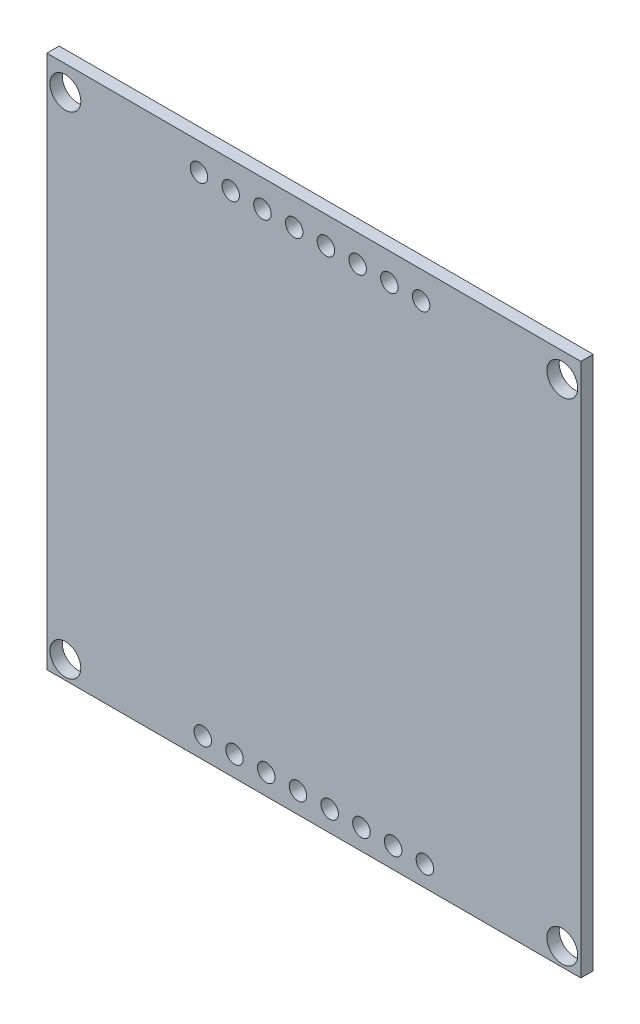
ISO-10303-21;
HEADER;
FILE_DESCRIPTION(('STEP AP214'),'2;1');
FILE_NAME('part.step','',(''),(''),'','','');
FILE_SCHEMA(('AUTOMOTIVE_DESIGN { 1 0 10303 214 1 1 1 1 }'));
ENDSEC;
DATA;
#1=APPLICATION_CONTEXT('core data for automotive mechanical design processes');
#2=APPLICATION_PROTOCOL_DEFINITION('international standard','automotive_design',2000,#1);
#3=PRODUCT_CONTEXT('',#1,'mechanical');
#4=PRODUCT('Part','Part','',(#3));
#5=PRODUCT_RELATED_PRODUCT_CATEGORY('part','',(#4));
#6=PRODUCT_DEFINITION_FORMATION('','',#4);
#7=PRODUCT_DEFINITION_CONTEXT('part definition',#1,'design');
#8=PRODUCT_DEFINITION('design','',#6,#7);
#9=PRODUCT_DEFINITION_SHAPE('','',#8);
#10=(LENGTH_UNIT() NAMED_UNIT(*) SI_UNIT(.MILLI.,.METRE.));
#11=(NAMED_UNIT(*) PLANE_ANGLE_UNIT() SI_UNIT($,.RADIAN.));
#12=(NAMED_UNIT(*) SI_UNIT($,.STERADIAN.) SOLID_ANGLE_UNIT());
#13=UNCERTAINTY_MEASURE_WITH_UNIT(LENGTH_MEASURE(1.E-05),#10,'distance_accuracy_value','');
#14=(GEOMETRIC_REPRESENTATION_CONTEXT(3) GLOBAL_UNCERTAINTY_ASSIGNED_CONTEXT((#13)) GLOBAL_UNIT_ASSIGNED_CONTEXT((#10,
#11,#12)) REPRESENTATION_CONTEXT('',''));
#15=CARTESIAN_POINT('',(0.,0.,0.));
#16=DIRECTION('',(0.,0.,1.));
#17=DIRECTION('',(1.,0.,0.));
#18=AXIS2_PLACEMENT_3D('',#15,#16,#17);
#19=CARTESIAN_POINT('',(0.,0.,1.));
#20=DIRECTION('',(0.,0.,-1.));
#21=DIRECTION('',(-1.,0.,0.));
#22=AXIS2_PLACEMENT_3D('',#19,#20,#21);
#23=PLANE('',#22);
#24=CARTESIAN_POINT('',(1.5,1.47673648000744,1.));
#25=DIRECTION('',(0.,0.,1.));
#26=DIRECTION('',(1.,0.,0.));
#27=AXIS2_PLACEMENT_3D('',#24,#25,#26);
#28=CIRCLE('',#27,1.25);
#29=CARTESIAN_POINT('',(2.75,1.47673648000744,1.));
#30=VERTEX_POINT('',#29);
#31=EDGE_CURVE('E216',#30,#30,#28,.T.);
#32=ORIENTED_EDGE('',*,*,#31,.F.);
#33=EDGE_LOOP('',(#32));
#34=FACE_BOUND('',#33,.T.);
#35=CARTESIAN_POINT('',(41.75,1.47673648000744,1.));
#36=DIRECTION('',(0.,0.,1.));
#37=DIRECTION('',(-1.,0.,0.));
#38=AXIS2_PLACEMENT_3D('',#35,#36,#37);
#39=CIRCLE('',#38,1.25);
#40=CARTESIAN_POINT('',(40.5,1.47673648000744,1.));
#41=VERTEX_POINT('',#40);
#42=EDGE_CURVE('E204',#41,#41,#39,.T.);
#43=ORIENTED_EDGE('',*,*,#42,.F.);
#44=EDGE_LOOP('',(#43));
#45=FACE_BOUND('',#44,.T.);
#46=CARTESIAN_POINT('',(20.34,1.67673648000722,1.));
#47=DIRECTION('',(0.,0.,1.));
#48=DIRECTION('',(-1.,0.,0.));
#49=AXIS2_PLACEMENT_3D('',#46,#47,#48);
#50=CIRCLE('',#49,0.707384328542562);
#51=CARTESIAN_POINT('',(19.6326156714574,1.67673648000722,1.));
#52=VERTEX_POINT('',#51);
#53=EDGE_CURVE('E192',#52,#52,#50,.T.);
#54=ORIENTED_EDGE('',*,*,#53,.F.);
#55=EDGE_LOOP('',(#54));
#56=FACE_BOUND('',#55,.T.);
#57=CARTESIAN_POINT('',(25.48,1.67673648000723,1.));
#58=DIRECTION('',(0.,0.,1.));
#59=DIRECTION('',(-1.,0.,0.));
#60=AXIS2_PLACEMENT_3D('',#57,#58,#59);
#61=CIRCLE('',#60,0.707384328542562);
#62=CARTESIAN_POINT('',(24.7726156714574,1.67673648000723,1.));
#63=VERTEX_POINT('',#62);
#64=EDGE_CURVE('E180',#63,#63,#61,.T.);
#65=ORIENTED_EDGE('',*,*,#64,.F.);
#66=EDGE_LOOP('',(#65));
#67=FACE_BOUND('',#66,.T.);
#68=CARTESIAN_POINT('',(30.62,1.67673648000723,1.));
#69=DIRECTION('',(0.,0.,1.));
#70=DIRECTION('',(-1.,0.,0.));
#71=AXIS2_PLACEMENT_3D('',#68,#69,#70);
#72=CIRCLE('',#71,0.707384328542566);
#73=CARTESIAN_POINT('',(29.9126156714574,1.67673648000723,1.));
#74=VERTEX_POINT('',#73);
#75=EDGE_CURVE('E168',#74,#74,#72,.T.);
#76=ORIENTED_EDGE('',*,*,#75,.F.);
#77=EDGE_LOOP('',(#76));
#78=FACE_BOUND('',#77,.T.);
#79=CARTESIAN_POINT('',(30.3125670065612,41.0314532498455,1.));
#80=DIRECTION('',(0.,0.,1.));
#81=DIRECTION('',(1.,0.,0.));
#82=AXIS2_PLACEMENT_3D('',#79,#80,#81);
#83=CIRCLE('',#82,0.707384328542565);
#84=CARTESIAN_POINT('',(31.0199513351037,41.0314532498455,1.));
#85=VERTEX_POINT('',#84);
#86=EDGE_CURVE('E156',#85,#85,#83,.T.);
#87=ORIENTED_EDGE('',*,*,#86,.F.);
#88=EDGE_LOOP('',(#87));
#89=FACE_BOUND('',#88,.T.);
#90=CARTESIAN_POINT('',(25.1725697380948,41.0367523213182,1.));
#91=DIRECTION('',(0.,0.,1.));
#92=DIRECTION('',(1.,0.,0.));
#93=AXIS2_PLACEMENT_3D('',#90,#91,#92);
#94=CIRCLE('',#93,0.707384328542558);
#95=CARTESIAN_POINT('',(25.8799540666374,41.0367523213182,1.));
#96=VERTEX_POINT('',#95);
#97=EDGE_CURVE('E144',#96,#96,#94,.T.);
#98=ORIENTED_EDGE('',*,*,#97,.F.);
#99=EDGE_LOOP('',(#98));
#100=FACE_BOUND('',#99,.T.);
#101=CARTESIAN_POINT('',(20.0325724696285,41.0420513927909,1.));
#102=DIRECTION('',(0.,0.,1.));
#103=DIRECTION('',(1.,0.,0.));
#104=AXIS2_PLACEMENT_3D('',#101,#102,#103);
#105=CIRCLE('',#104,0.707384328542558);
#106=CARTESIAN_POINT('',(20.739956798171,41.0420513927909,1.));
#107=VERTEX_POINT('',#106);
#108=EDGE_CURVE('E132',#107,#107,#105,.T.);
#109=ORIENTED_EDGE('',*,*,#108,.F.);
#110=EDGE_LOOP('',(#109));
#111=FACE_BOUND('',#110,.T.);
#112=CARTESIAN_POINT('',(14.8925752011621,41.0473504642636,1.));
#113=DIRECTION('',(0.,0.,1.));
#114=DIRECTION('',(1.,0.,0.));
#115=AXIS2_PLACEMENT_3D('',#112,#113,#114);
#116=CIRCLE('',#115,0.707384328542558);
#117=CARTESIAN_POINT('',(15.5999595297047,41.0473504642636,1.));
#118=VERTEX_POINT('',#117);
#119=EDGE_CURVE('E120',#118,#118,#116,.T.);
#120=ORIENTED_EDGE('',*,*,#119,.F.);
#121=EDGE_LOOP('',(#120));
#122=FACE_BOUND('',#121,.T.);
#123=CARTESIAN_POINT('',(12.3225765669289,41.05,1.));
#124=DIRECTION('',(0.,0.,1.));
#125=DIRECTION('',(1.,0.,0.));
#126=AXIS2_PLACEMENT_3D('',#123,#124,#125);
#127=CIRCLE('',#126,0.70738432854256);
#128=CARTESIAN_POINT('',(13.0299608954715,41.05,1.));
#129=VERTEX_POINT('',#128);
#130=EDGE_CURVE('E99',#129,#129,#127,.T.);
#131=ORIENTED_EDGE('',*,*,#130,.F.);
#132=EDGE_LOOP('',(#131));
#133=FACE_BOUND('',#132,.T.);
#134=DIRECTION('',(0.,-1.,0.));
#135=VECTOR('',#134,1.);
#136=CARTESIAN_POINT('',(0.,0.,1.));
#137=LINE('',#136,#135);
#138=CARTESIAN_POINT('',(0.,43.25,1.));
#139=VERTEX_POINT('',#138);
#140=CARTESIAN_POINT('',(0.,0.,1.));
#141=VERTEX_POINT('',#140);
#142=EDGE_CURVE('E84',#139,#141,#137,.T.);
#143=ORIENTED_EDGE('',*,*,#142,.T.);
#144=DIRECTION('',(1.,0.,0.));
#145=VECTOR('',#144,1.);
#146=CARTESIAN_POINT('',(0.,0.,1.));
#147=LINE('',#146,#145);
#148=CARTESIAN_POINT('',(43.25,0.,1.));
#149=VERTEX_POINT('',#148);
#150=EDGE_CURVE('E79',#141,#149,#147,.T.);
#151=ORIENTED_EDGE('',*,*,#150,.T.);
#152=DIRECTION('',(0.,1.,0.));
#153=VECTOR('',#152,1.);
#154=CARTESIAN_POINT('',(43.25,0.,1.));
#155=LINE('',#154,#153);
#156=CARTESIAN_POINT('',(43.25,43.25,1.));
#157=VERTEX_POINT('',#156);
#158=EDGE_CURVE('E82',#149,#157,#155,.T.);
#159=ORIENTED_EDGE('',*,*,#158,.T.);
#160=DIRECTION('',(-1.,0.,0.));
#161=VECTOR('',#160,1.);
#162=CARTESIAN_POINT('',(0.,43.25,1.));
#163=LINE('',#162,#161);
#164=EDGE_CURVE('E49',#157,#139,#163,.T.);
#165=ORIENTED_EDGE('',*,*,#164,.T.);
#166=EDGE_LOOP('',(#143,#151,#159,#165));
#167=FACE_BOUND('',#166,.T.);
#168=CARTESIAN_POINT('',(41.75,41.25,1.));
#169=DIRECTION('',(0.,0.,1.));
#170=DIRECTION('',(1.,0.,0.));
#171=AXIS2_PLACEMENT_3D('',#168,#169,#170);
#172=CIRCLE('',#171,1.25);
#173=CARTESIAN_POINT('',(43.,41.25,1.));
#174=VERTEX_POINT('',#173);
#175=EDGE_CURVE('E114',#174,#174,#172,.T.);
#176=ORIENTED_EDGE('',*,*,#175,.F.);
#177=EDGE_LOOP('',(#176));
#178=FACE_BOUND('',#177,.T.);
#179=CARTESIAN_POINT('',(17.4625738353953,41.0447009285273,1.));
#180=DIRECTION('',(0.,0.,1.));
#181=DIRECTION('',(1.,0.,0.));
#182=AXIS2_PLACEMENT_3D('',#179,#180,#181);
#183=CIRCLE('',#182,0.707384328542562);
#184=CARTESIAN_POINT('',(18.1699581639378,41.0447009285273,1.));
#185=VERTEX_POINT('',#184);
#186=EDGE_CURVE('E126',#185,#185,#183,.T.);
#187=ORIENTED_EDGE('',*,*,#186,.F.);
#188=EDGE_LOOP('',(#187));
#189=FACE_BOUND('',#188,.T.);
#190=CARTESIAN_POINT('',(22.6025711038616,41.0394018570546,1.));
#191=DIRECTION('',(0.,0.,1.));
#192=DIRECTION('',(1.,0.,0.));
#193=AXIS2_PLACEMENT_3D('',#190,#191,#192);
#194=CIRCLE('',#193,0.707384328542562);
#195=CARTESIAN_POINT('',(23.3099554324042,41.0394018570546,1.));
#196=VERTEX_POINT('',#195);
#197=EDGE_CURVE('E138',#196,#196,#194,.T.);
#198=ORIENTED_EDGE('',*,*,#197,.F.);
#199=EDGE_LOOP('',(#198));
#200=FACE_BOUND('',#199,.T.);
#201=CARTESIAN_POINT('',(27.742568372328,41.0341027855819,1.));
#202=DIRECTION('',(0.,0.,1.));
#203=DIRECTION('',(1.,0.,0.));
#204=AXIS2_PLACEMENT_3D('',#201,#202,#203);
#205=CIRCLE('',#204,0.707384328542558);
#206=CARTESIAN_POINT('',(28.4499527008705,41.0341027855819,1.));
#207=VERTEX_POINT('',#206);
#208=EDGE_CURVE('E150',#207,#207,#205,.T.);
#209=ORIENTED_EDGE('',*,*,#208,.F.);
#210=EDGE_LOOP('',(#209));
#211=FACE_BOUND('',#210,.T.);
#212=CARTESIAN_POINT('',(1.5,41.25,1.));
#213=DIRECTION('',(0.,0.,1.));
#214=DIRECTION('',(-1.,0.,0.));
#215=AXIS2_PLACEMENT_3D('',#212,#213,#214);
#216=CIRCLE('',#215,1.25);
#217=CARTESIAN_POINT('',(0.250000000000003,41.25,1.));
#218=VERTEX_POINT('',#217);
#219=EDGE_CURVE('E162',#218,#218,#216,.T.);
#220=ORIENTED_EDGE('',*,*,#219,.F.);
#221=EDGE_LOOP('',(#220));
#222=FACE_BOUND('',#221,.T.);
#223=CARTESIAN_POINT('',(28.05,1.67673648000723,1.));
#224=DIRECTION('',(0.,0.,1.));
#225=DIRECTION('',(-1.,0.,0.));
#226=AXIS2_PLACEMENT_3D('',#223,#224,#225);
#227=CIRCLE('',#226,0.707384328542562);
#228=CARTESIAN_POINT('',(27.3426156714574,1.67673648000723,1.));
#229=VERTEX_POINT('',#228);
#230=EDGE_CURVE('E174',#229,#229,#227,.T.);
#231=ORIENTED_EDGE('',*,*,#230,.F.);
#232=EDGE_LOOP('',(#231));
#233=FACE_BOUND('',#232,.T.);
#234=CARTESIAN_POINT('',(22.91,1.67673648000722,1.));
#235=DIRECTION('',(0.,0.,1.));
#236=DIRECTION('',(-1.,0.,0.));
#237=AXIS2_PLACEMENT_3D('',#234,#235,#236);
#238=CIRCLE('',#237,0.707384328542562);
#239=CARTESIAN_POINT('',(22.2026156714574,1.67673648000722,1.));
#240=VERTEX_POINT('',#239);
#241=EDGE_CURVE('E186',#240,#240,#238,.T.);
#242=ORIENTED_EDGE('',*,*,#241,.F.);
#243=EDGE_LOOP('',(#242));
#244=FACE_BOUND('',#243,.T.);
#245=CARTESIAN_POINT('',(17.77,1.67673648000722,1.));
#246=DIRECTION('',(0.,0.,1.));
#247=DIRECTION('',(-1.,0.,0.));
#248=AXIS2_PLACEMENT_3D('',#245,#246,#247);
#249=CIRCLE('',#248,0.707384328542562);
#250=CARTESIAN_POINT('',(17.0626156714574,1.67673648000722,1.));
#251=VERTEX_POINT('',#250);
#252=EDGE_CURVE('E198',#251,#251,#249,.T.);
#253=ORIENTED_EDGE('',*,*,#252,.F.);
#254=EDGE_LOOP('',(#253));
#255=FACE_BOUND('',#254,.T.);
#256=CARTESIAN_POINT('',(15.2,1.67673648000722,1.));
#257=DIRECTION('',(0.,0.,1.));
#258=DIRECTION('',(-1.,0.,0.));
#259=AXIS2_PLACEMENT_3D('',#256,#257,#258);
#260=CIRCLE('',#259,0.707384328542562);
#261=CARTESIAN_POINT('',(14.4926156714574,1.67673648000722,1.));
#262=VERTEX_POINT('',#261);
#263=EDGE_CURVE('E210',#262,#262,#260,.T.);
#264=ORIENTED_EDGE('',*,*,#263,.F.);
#265=EDGE_LOOP('',(#264));
#266=FACE_BOUND('',#265,.T.);
#267=CARTESIAN_POINT('',(12.63,1.67673648000723,1.));
#268=DIRECTION('',(0.,0.,1.));
#269=DIRECTION('',(-1.,0.,0.));
#270=AXIS2_PLACEMENT_3D('',#267,#268,#269);
#271=CIRCLE('',#270,0.707384328542562);
#272=CARTESIAN_POINT('',(11.9226156714574,1.67673648000723,1.));
#273=VERTEX_POINT('',#272);
#274=EDGE_CURVE('E222',#273,#273,#271,.T.);
#275=ORIENTED_EDGE('',*,*,#274,.F.);
#276=EDGE_LOOP('',(#275));
#277=FACE_BOUND('',#276,.T.);
#278=ADVANCED_FACE('F32',(#34,#45,#56,#67,#78,#89,#100,#111,#122,#133,#167,#178,#189,#200,#211,
#222,#233,#244,#255,#266,#277),#23,.F.);
#279=CARTESIAN_POINT('',(0.,0.,0.));
#280=DIRECTION('',(0.,0.,-1.));
#281=DIRECTION('',(-1.,0.,0.));
#282=AXIS2_PLACEMENT_3D('',#279,#280,#281);
#283=PLANE('',#282);
#284=CARTESIAN_POINT('',(1.5,1.47673648000744,0.));
#285=DIRECTION('',(0.,0.,1.));
#286=DIRECTION('',(1.,0.,0.));
#287=AXIS2_PLACEMENT_3D('',#284,#285,#286);
#288=CIRCLE('',#287,1.25);
#289=CARTESIAN_POINT('',(2.75,1.47673648000744,0.));
#290=VERTEX_POINT('',#289);
#291=EDGE_CURVE('E219',#290,#290,#288,.T.);
#292=ORIENTED_EDGE('',*,*,#291,.T.);
#293=EDGE_LOOP('',(#292));
#294=FACE_BOUND('',#293,.T.);
#295=CARTESIAN_POINT('',(41.75,1.47673648000744,0.));
#296=DIRECTION('',(0.,0.,1.));
#297=DIRECTION('',(-1.,0.,0.));
#298=AXIS2_PLACEMENT_3D('',#295,#296,#297);
#299=CIRCLE('',#298,1.25);
#300=CARTESIAN_POINT('',(40.5,1.47673648000744,0.));
#301=VERTEX_POINT('',#300);
#302=EDGE_CURVE('E207',#301,#301,#299,.T.);
#303=ORIENTED_EDGE('',*,*,#302,.T.);
#304=EDGE_LOOP('',(#303));
#305=FACE_BOUND('',#304,.T.);
#306=CARTESIAN_POINT('',(20.34,1.67673648000722,0.));
#307=DIRECTION('',(0.,0.,1.));
#308=DIRECTION('',(-1.,0.,0.));
#309=AXIS2_PLACEMENT_3D('',#306,#307,#308);
#310=CIRCLE('',#309,0.707384328542562);
#311=CARTESIAN_POINT('',(19.6326156714574,1.67673648000722,0.));
#312=VERTEX_POINT('',#311);
#313=EDGE_CURVE('E195',#312,#312,#310,.T.);
#314=ORIENTED_EDGE('',*,*,#313,.T.);
#315=EDGE_LOOP('',(#314));
#316=FACE_BOUND('',#315,.T.);
#317=CARTESIAN_POINT('',(25.48,1.67673648000723,0.));
#318=DIRECTION('',(0.,0.,1.));
#319=DIRECTION('',(-1.,0.,0.));
#320=AXIS2_PLACEMENT_3D('',#317,#318,#319);
#321=CIRCLE('',#320,0.707384328542562);
#322=CARTESIAN_POINT('',(24.7726156714574,1.67673648000723,0.));
#323=VERTEX_POINT('',#322);
#324=EDGE_CURVE('E183',#323,#323,#321,.T.);
#325=ORIENTED_EDGE('',*,*,#324,.T.);
#326=EDGE_LOOP('',(#325));
#327=FACE_BOUND('',#326,.T.);
#328=CARTESIAN_POINT('',(30.62,1.67673648000723,0.));
#329=DIRECTION('',(0.,0.,1.));
#330=DIRECTION('',(-1.,0.,0.));
#331=AXIS2_PLACEMENT_3D('',#328,#329,#330);
#332=CIRCLE('',#331,0.707384328542566);
#333=CARTESIAN_POINT('',(29.9126156714574,1.67673648000723,0.));
#334=VERTEX_POINT('',#333);
#335=EDGE_CURVE('E171',#334,#334,#332,.T.);
#336=ORIENTED_EDGE('',*,*,#335,.T.);
#337=EDGE_LOOP('',(#336));
#338=FACE_BOUND('',#337,.T.);
#339=CARTESIAN_POINT('',(30.3125670065612,41.0314532498455,0.));
#340=DIRECTION('',(0.,0.,1.));
#341=DIRECTION('',(1.,0.,0.));
#342=AXIS2_PLACEMENT_3D('',#339,#340,#341);
#343=CIRCLE('',#342,0.707384328542565);
#344=CARTESIAN_POINT('',(31.0199513351037,41.0314532498455,0.));
#345=VERTEX_POINT('',#344);
#346=EDGE_CURVE('E159',#345,#345,#343,.T.);
#347=ORIENTED_EDGE('',*,*,#346,.T.);
#348=EDGE_LOOP('',(#347));
#349=FACE_BOUND('',#348,.T.);
#350=CARTESIAN_POINT('',(25.1725697380948,41.0367523213182,0.));
#351=DIRECTION('',(0.,0.,1.));
#352=DIRECTION('',(1.,0.,0.));
#353=AXIS2_PLACEMENT_3D('',#350,#351,#352);
#354=CIRCLE('',#353,0.707384328542558);
#355=CARTESIAN_POINT('',(25.8799540666374,41.0367523213182,0.));
#356=VERTEX_POINT('',#355);
#357=EDGE_CURVE('E147',#356,#356,#354,.T.);
#358=ORIENTED_EDGE('',*,*,#357,.T.);
#359=EDGE_LOOP('',(#358));
#360=FACE_BOUND('',#359,.T.);
#361=CARTESIAN_POINT('',(20.0325724696285,41.0420513927909,0.));
#362=DIRECTION('',(0.,0.,1.));
#363=DIRECTION('',(1.,0.,0.));
#364=AXIS2_PLACEMENT_3D('',#361,#362,#363);
#365=CIRCLE('',#364,0.707384328542558);
#366=CARTESIAN_POINT('',(20.739956798171,41.0420513927909,0.));
#367=VERTEX_POINT('',#366);
#368=EDGE_CURVE('E135',#367,#367,#365,.T.);
#369=ORIENTED_EDGE('',*,*,#368,.T.);
#370=EDGE_LOOP('',(#369));
#371=FACE_BOUND('',#370,.T.);
#372=CARTESIAN_POINT('',(14.8925752011621,41.0473504642636,0.));
#373=DIRECTION('',(0.,0.,1.));
#374=DIRECTION('',(1.,0.,0.));
#375=AXIS2_PLACEMENT_3D('',#372,#373,#374);
#376=CIRCLE('',#375,0.707384328542558);
#377=CARTESIAN_POINT('',(15.5999595297047,41.0473504642636,0.));
#378=VERTEX_POINT('',#377);
#379=EDGE_CURVE('E123',#378,#378,#376,.T.);
#380=ORIENTED_EDGE('',*,*,#379,.T.);
#381=EDGE_LOOP('',(#380));
#382=FACE_BOUND('',#381,.T.);
#383=CARTESIAN_POINT('',(12.3225765669289,41.05,0.));
#384=DIRECTION('',(0.,0.,1.));
#385=DIRECTION('',(1.,0.,0.));
#386=AXIS2_PLACEMENT_3D('',#383,#384,#385);
#387=CIRCLE('',#386,0.70738432854256);
#388=CARTESIAN_POINT('',(13.0299608954715,41.05,0.));
#389=VERTEX_POINT('',#388);
#390=EDGE_CURVE('E111',#389,#389,#387,.T.);
#391=ORIENTED_EDGE('',*,*,#390,.T.);
#392=EDGE_LOOP('',(#391));
#393=FACE_BOUND('',#392,.T.);
#394=DIRECTION('',(0.,-1.,0.));
#395=VECTOR('',#394,1.);
#396=CARTESIAN_POINT('',(0.,0.,0.));
#397=LINE('',#396,#395);
#398=CARTESIAN_POINT('',(0.,43.25,0.));
#399=VERTEX_POINT('',#398);
#400=CARTESIAN_POINT('',(0.,0.,0.));
#401=VERTEX_POINT('',#400);
#402=EDGE_CURVE('E96',#399,#401,#397,.T.);
#403=ORIENTED_EDGE('',*,*,#402,.F.);
#404=DIRECTION('',(-1.,0.,0.));
#405=VECTOR('',#404,1.);
#406=CARTESIAN_POINT('',(0.,43.25,0.));
#407=LINE('',#406,#405);
#408=CARTESIAN_POINT('',(43.25,43.25,0.));
#409=VERTEX_POINT('',#408);
#410=EDGE_CURVE('E72',#409,#399,#407,.T.);
#411=ORIENTED_EDGE('',*,*,#410,.F.);
#412=DIRECTION('',(0.,1.,0.));
#413=VECTOR('',#412,1.);
#414=CARTESIAN_POINT('',(43.25,0.,0.));
#415=LINE('',#414,#413);
#416=CARTESIAN_POINT('',(43.25,0.,0.));
#417=VERTEX_POINT('',#416);
#418=EDGE_CURVE('E66',#417,#409,#415,.T.);
#419=ORIENTED_EDGE('',*,*,#418,.F.);
#420=DIRECTION('',(1.,0.,0.));
#421=VECTOR('',#420,1.);
#422=CARTESIAN_POINT('',(0.,0.,0.));
#423=LINE('',#422,#421);
#424=EDGE_CURVE('E88',#401,#417,#423,.T.);
#425=ORIENTED_EDGE('',*,*,#424,.F.);
#426=EDGE_LOOP('',(#403,#411,#419,#425));
#427=FACE_BOUND('',#426,.T.);
#428=CARTESIAN_POINT('',(41.75,41.25,0.));
#429=DIRECTION('',(0.,0.,1.));
#430=DIRECTION('',(1.,0.,0.));
#431=AXIS2_PLACEMENT_3D('',#428,#429,#430);
#432=CIRCLE('',#431,1.25);
#433=CARTESIAN_POINT('',(43.,41.25,0.));
#434=VERTEX_POINT('',#433);
#435=EDGE_CURVE('E117',#434,#434,#432,.T.);
#436=ORIENTED_EDGE('',*,*,#435,.T.);
#437=EDGE_LOOP('',(#436));
#438=FACE_BOUND('',#437,.T.);
#439=CARTESIAN_POINT('',(17.4625738353953,41.0447009285273,0.));
#440=DIRECTION('',(0.,0.,1.));
#441=DIRECTION('',(1.,0.,0.));
#442=AXIS2_PLACEMENT_3D('',#439,#440,#441);
#443=CIRCLE('',#442,0.707384328542562);
#444=CARTESIAN_POINT('',(18.1699581639378,41.0447009285273,0.));
#445=VERTEX_POINT('',#444);
#446=EDGE_CURVE('E129',#445,#445,#443,.T.);
#447=ORIENTED_EDGE('',*,*,#446,.T.);
#448=EDGE_LOOP('',(#447));
#449=FACE_BOUND('',#448,.T.);
#450=CARTESIAN_POINT('',(22.6025711038616,41.0394018570546,0.));
#451=DIRECTION('',(0.,0.,1.));
#452=DIRECTION('',(1.,0.,0.));
#453=AXIS2_PLACEMENT_3D('',#450,#451,#452);
#454=CIRCLE('',#453,0.707384328542562);
#455=CARTESIAN_POINT('',(23.3099554324042,41.0394018570546,0.));
#456=VERTEX_POINT('',#455);
#457=EDGE_CURVE('E141',#456,#456,#454,.T.);
#458=ORIENTED_EDGE('',*,*,#457,.T.);
#459=EDGE_LOOP('',(#458));
#460=FACE_BOUND('',#459,.T.);
#461=CARTESIAN_POINT('',(27.742568372328,41.0341027855819,0.));
#462=DIRECTION('',(0.,0.,1.));
#463=DIRECTION('',(1.,0.,0.));
#464=AXIS2_PLACEMENT_3D('',#461,#462,#463);
#465=CIRCLE('',#464,0.707384328542558);
#466=CARTESIAN_POINT('',(28.4499527008705,41.0341027855819,0.));
#467=VERTEX_POINT('',#466);
#468=EDGE_CURVE('E153',#467,#467,#465,.T.);
#469=ORIENTED_EDGE('',*,*,#468,.T.);
#470=EDGE_LOOP('',(#469));
#471=FACE_BOUND('',#470,.T.);
#472=CARTESIAN_POINT('',(1.5,41.25,0.));
#473=DIRECTION('',(0.,0.,1.));
#474=DIRECTION('',(-1.,0.,0.));
#475=AXIS2_PLACEMENT_3D('',#472,#473,#474);
#476=CIRCLE('',#475,1.25);
#477=CARTESIAN_POINT('',(0.250000000000003,41.25,0.));
#478=VERTEX_POINT('',#477);
#479=EDGE_CURVE('E165',#478,#478,#476,.T.);
#480=ORIENTED_EDGE('',*,*,#479,.T.);
#481=EDGE_LOOP('',(#480));
#482=FACE_BOUND('',#481,.T.);
#483=CARTESIAN_POINT('',(28.05,1.67673648000723,0.));
#484=DIRECTION('',(0.,0.,1.));
#485=DIRECTION('',(-1.,0.,0.));
#486=AXIS2_PLACEMENT_3D('',#483,#484,#485);
#487=CIRCLE('',#486,0.707384328542562);
#488=CARTESIAN_POINT('',(27.3426156714574,1.67673648000723,0.));
#489=VERTEX_POINT('',#488);
#490=EDGE_CURVE('E177',#489,#489,#487,.T.);
#491=ORIENTED_EDGE('',*,*,#490,.T.);
#492=EDGE_LOOP('',(#491));
#493=FACE_BOUND('',#492,.T.);
#494=CARTESIAN_POINT('',(22.91,1.67673648000722,0.));
#495=DIRECTION('',(0.,0.,1.));
#496=DIRECTION('',(-1.,0.,0.));
#497=AXIS2_PLACEMENT_3D('',#494,#495,#496);
#498=CIRCLE('',#497,0.707384328542562);
#499=CARTESIAN_POINT('',(22.2026156714574,1.67673648000722,0.));
#500=VERTEX_POINT('',#499);
#501=EDGE_CURVE('E189',#500,#500,#498,.T.);
#502=ORIENTED_EDGE('',*,*,#501,.T.);
#503=EDGE_LOOP('',(#502));
#504=FACE_BOUND('',#503,.T.);
#505=CARTESIAN_POINT('',(17.77,1.67673648000722,0.));
#506=DIRECTION('',(0.,0.,1.));
#507=DIRECTION('',(-1.,0.,0.));
#508=AXIS2_PLACEMENT_3D('',#505,#506,#507);
#509=CIRCLE('',#508,0.707384328542562);
#510=CARTESIAN_POINT('',(17.0626156714574,1.67673648000722,0.));
#511=VERTEX_POINT('',#510);
#512=EDGE_CURVE('E201',#511,#511,#509,.T.);
#513=ORIENTED_EDGE('',*,*,#512,.T.);
#514=EDGE_LOOP('',(#513));
#515=FACE_BOUND('',#514,.T.);
#516=CARTESIAN_POINT('',(15.2,1.67673648000722,0.));
#517=DIRECTION('',(0.,0.,1.));
#518=DIRECTION('',(-1.,0.,0.));
#519=AXIS2_PLACEMENT_3D('',#516,#517,#518);
#520=CIRCLE('',#519,0.707384328542562);
#521=CARTESIAN_POINT('',(14.4926156714574,1.67673648000722,0.));
#522=VERTEX_POINT('',#521);
#523=EDGE_CURVE('E213',#522,#522,#520,.T.);
#524=ORIENTED_EDGE('',*,*,#523,.T.);
#525=EDGE_LOOP('',(#524));
#526=FACE_BOUND('',#525,.T.);
#527=CARTESIAN_POINT('',(12.63,1.67673648000723,0.));
#528=DIRECTION('',(0.,0.,1.));
#529=DIRECTION('',(-1.,0.,0.));
#530=AXIS2_PLACEMENT_3D('',#527,#528,#529);
#531=CIRCLE('',#530,0.707384328542562);
#532=CARTESIAN_POINT('',(11.9226156714574,1.67673648000723,0.));
#533=VERTEX_POINT('',#532);
#534=EDGE_CURVE('E225',#533,#533,#531,.T.);
#535=ORIENTED_EDGE('',*,*,#534,.T.);
#536=EDGE_LOOP('',(#535));
#537=FACE_BOUND('',#536,.T.);
#538=ADVANCED_FACE('F107',(#294,#305,#316,#327,#338,#349,#360,#371,#382,#393,#427,#438,#449,
#460,#471,#482,#493,#504,#515,#526,#537),#283,.T.);
#539=CARTESIAN_POINT('',(0.,0.,1.));
#540=DIRECTION('',(1.,0.,0.));
#541=DIRECTION('',(0.,0.,-1.));
#542=AXIS2_PLACEMENT_3D('',#539,#540,#541);
#543=PLANE('',#542);
#544=ORIENTED_EDGE('',*,*,#402,.T.);
#545=DIRECTION('',(0.,0.,-1.));
#546=VECTOR('',#545,1.);
#547=CARTESIAN_POINT('',(0.,0.,1.));
#548=LINE('',#547,#546);
#549=EDGE_CURVE('E11',#141,#401,#548,.T.);
#550=ORIENTED_EDGE('',*,*,#549,.F.);
#551=ORIENTED_EDGE('',*,*,#142,.F.);
#552=DIRECTION('',(0.,0.,-1.));
#553=VECTOR('',#552,1.);
#554=CARTESIAN_POINT('',(0.,43.25,1.));
#555=LINE('',#554,#553);
#556=EDGE_CURVE('E92',#139,#399,#555,.T.);
#557=ORIENTED_EDGE('',*,*,#556,.T.);
#558=EDGE_LOOP('',(#544,#550,#551,#557));
#559=FACE_BOUND('',#558,.T.);
#560=ADVANCED_FACE('F34',(#559),#543,.F.);
#561=CARTESIAN_POINT('',(0.,0.,1.));
#562=DIRECTION('',(0.,1.,0.));
#563=DIRECTION('',(0.,0.,1.));
#564=AXIS2_PLACEMENT_3D('',#561,#562,#563);
#565=PLANE('',#564);
#566=ORIENTED_EDGE('',*,*,#424,.T.);
#567=DIRECTION('',(0.,0.,-1.));
#568=VECTOR('',#567,1.);
#569=CARTESIAN_POINT('',(43.25,0.,1.));
#570=LINE('',#569,#568);
#571=EDGE_CURVE('E41',#149,#417,#570,.T.);
#572=ORIENTED_EDGE('',*,*,#571,.F.);
#573=ORIENTED_EDGE('',*,*,#150,.F.);
#574=ORIENTED_EDGE('',*,*,#549,.T.);
#575=EDGE_LOOP('',(#566,#572,#573,#574));
#576=FACE_BOUND('',#575,.T.);
#577=ADVANCED_FACE('F87',(#576),#565,.F.);
#578=CARTESIAN_POINT('',(43.25,0.,1.));
#579=DIRECTION('',(-1.,0.,0.));
#580=DIRECTION('',(0.,0.,1.));
#581=AXIS2_PLACEMENT_3D('',#578,#579,#580);
#582=PLANE('',#581);
#583=ORIENTED_EDGE('',*,*,#418,.T.);
#584=DIRECTION('',(0.,0.,-1.));
#585=VECTOR('',#584,1.);
#586=CARTESIAN_POINT('',(43.25,43.25,1.));
#587=LINE('',#586,#585);
#588=EDGE_CURVE('E89',#157,#409,#587,.T.);
#589=ORIENTED_EDGE('',*,*,#588,.F.);
#590=ORIENTED_EDGE('',*,*,#158,.F.);
#591=ORIENTED_EDGE('',*,*,#571,.T.);
#592=EDGE_LOOP('',(#583,#589,#590,#591));
#593=FACE_BOUND('',#592,.T.);
#594=ADVANCED_FACE('F90',(#593),#582,.F.);
#595=CARTESIAN_POINT('',(0.,43.25,1.));
#596=DIRECTION('',(0.,-1.,0.));
#597=DIRECTION('',(0.,0.,-1.));
#598=AXIS2_PLACEMENT_3D('',#595,#596,#597);
#599=PLANE('',#598);
#600=ORIENTED_EDGE('',*,*,#410,.T.);
#601=ORIENTED_EDGE('',*,*,#556,.F.);
#602=ORIENTED_EDGE('',*,*,#164,.F.);
#603=ORIENTED_EDGE('',*,*,#588,.T.);
#604=EDGE_LOOP('',(#600,#601,#602,#603));
#605=FACE_BOUND('',#604,.T.);
#606=ADVANCED_FACE('F104',(#605),#599,.F.);
#607=CARTESIAN_POINT('',(12.3225765669289,41.05,1.));
#608=DIRECTION('',(0.,0.,-1.));
#609=DIRECTION('',(-1.,0.,0.));
#610=AXIS2_PLACEMENT_3D('',#607,#608,#609);
#611=CYLINDRICAL_SURFACE('',#610,0.70738432854256);
#612=ORIENTED_EDGE('',*,*,#130,.T.);
#613=EDGE_LOOP('',(#612));
#614=FACE_BOUND('',#613,.T.);
#615=ORIENTED_EDGE('',*,*,#390,.F.);
#616=EDGE_LOOP('',(#615));
#617=FACE_BOUND('',#616,.T.);
#618=ADVANCED_FACE('F245',(#614,#617),#611,.F.);
#619=CARTESIAN_POINT('',(41.75,41.25,1.));
#620=DIRECTION('',(0.,0.,-1.));
#621=DIRECTION('',(-1.,0.,0.));
#622=AXIS2_PLACEMENT_3D('',#619,#620,#621);
#623=CYLINDRICAL_SURFACE('',#622,1.25);
#624=ORIENTED_EDGE('',*,*,#175,.T.);
#625=EDGE_LOOP('',(#624));
#626=FACE_BOUND('',#625,.T.);
#627=ORIENTED_EDGE('',*,*,#435,.F.);
#628=EDGE_LOOP('',(#627));
#629=FACE_BOUND('',#628,.T.);
#630=ADVANCED_FACE('F300',(#626,#629),#623,.F.);
#631=CARTESIAN_POINT('',(14.8925752011621,41.0473504642636,1.));
#632=DIRECTION('',(0.,0.,-1.));
#633=DIRECTION('',(-1.,0.,0.));
#634=AXIS2_PLACEMENT_3D('',#631,#632,#633);
#635=CYLINDRICAL_SURFACE('',#634,0.707384328542558);
#636=ORIENTED_EDGE('',*,*,#119,.T.);
#637=EDGE_LOOP('',(#636));
#638=FACE_BOUND('',#637,.T.);
#639=ORIENTED_EDGE('',*,*,#379,.F.);
#640=EDGE_LOOP('',(#639));
#641=FACE_BOUND('',#640,.T.);
#642=ADVANCED_FACE('F308',(#638,#641),#635,.F.);
#643=CARTESIAN_POINT('',(17.4625738353953,41.0447009285273,1.));
#644=DIRECTION('',(0.,0.,-1.));
#645=DIRECTION('',(-1.,0.,0.));
#646=AXIS2_PLACEMENT_3D('',#643,#644,#645);
#647=CYLINDRICAL_SURFACE('',#646,0.707384328542562);
#648=ORIENTED_EDGE('',*,*,#186,.T.);
#649=EDGE_LOOP('',(#648));
#650=FACE_BOUND('',#649,.T.);
#651=ORIENTED_EDGE('',*,*,#446,.F.);
#652=EDGE_LOOP('',(#651));
#653=FACE_BOUND('',#652,.T.);
#654=ADVANCED_FACE('F316',(#650,#653),#647,.F.);
#655=CARTESIAN_POINT('',(20.0325724696285,41.0420513927909,1.));
#656=DIRECTION('',(0.,0.,-1.));
#657=DIRECTION('',(-1.,0.,0.));
#658=AXIS2_PLACEMENT_3D('',#655,#656,#657);
#659=CYLINDRICAL_SURFACE('',#658,0.707384328542558);
#660=ORIENTED_EDGE('',*,*,#108,.T.);
#661=EDGE_LOOP('',(#660));
#662=FACE_BOUND('',#661,.T.);
#663=ORIENTED_EDGE('',*,*,#368,.F.);
#664=EDGE_LOOP('',(#663));
#665=FACE_BOUND('',#664,.T.);
#666=ADVANCED_FACE('F325',(#662,#665),#659,.F.);
#667=CARTESIAN_POINT('',(22.6025711038616,41.0394018570546,1.));
#668=DIRECTION('',(0.,0.,-1.));
#669=DIRECTION('',(-1.,0.,0.));
#670=AXIS2_PLACEMENT_3D('',#667,#668,#669);
#671=CYLINDRICAL_SURFACE('',#670,0.707384328542562);
#672=ORIENTED_EDGE('',*,*,#197,.T.);
#673=EDGE_LOOP('',(#672));
#674=FACE_BOUND('',#673,.T.);
#675=ORIENTED_EDGE('',*,*,#457,.F.);
#676=EDGE_LOOP('',(#675));
#677=FACE_BOUND('',#676,.T.);
#678=ADVANCED_FACE('F334',(#674,#677),#671,.F.);
#679=CARTESIAN_POINT('',(25.1725697380948,41.0367523213182,1.));
#680=DIRECTION('',(0.,0.,-1.));
#681=DIRECTION('',(-1.,0.,0.));
#682=AXIS2_PLACEMENT_3D('',#679,#680,#681);
#683=CYLINDRICAL_SURFACE('',#682,0.707384328542558);
#684=ORIENTED_EDGE('',*,*,#97,.T.);
#685=EDGE_LOOP('',(#684));
#686=FACE_BOUND('',#685,.T.);
#687=ORIENTED_EDGE('',*,*,#357,.F.);
#688=EDGE_LOOP('',(#687));
#689=FACE_BOUND('',#688,.T.);
#690=ADVANCED_FACE('F343',(#686,#689),#683,.F.);
#691=CARTESIAN_POINT('',(27.742568372328,41.0341027855819,1.));
#692=DIRECTION('',(0.,0.,-1.));
#693=DIRECTION('',(-1.,0.,0.));
#694=AXIS2_PLACEMENT_3D('',#691,#692,#693);
#695=CYLINDRICAL_SURFACE('',#694,0.707384328542558);
#696=ORIENTED_EDGE('',*,*,#208,.T.);
#697=EDGE_LOOP('',(#696));
#698=FACE_BOUND('',#697,.T.);
#699=ORIENTED_EDGE('',*,*,#468,.F.);
#700=EDGE_LOOP('',(#699));
#701=FACE_BOUND('',#700,.T.);
#702=ADVANCED_FACE('F352',(#698,#701),#695,.F.);
#703=CARTESIAN_POINT('',(30.3125670065612,41.0314532498455,1.));
#704=DIRECTION('',(0.,0.,-1.));
#705=DIRECTION('',(-1.,0.,0.));
#706=AXIS2_PLACEMENT_3D('',#703,#704,#705);
#707=CYLINDRICAL_SURFACE('',#706,0.707384328542565);
#708=ORIENTED_EDGE('',*,*,#86,.T.);
#709=EDGE_LOOP('',(#708));
#710=FACE_BOUND('',#709,.T.);
#711=ORIENTED_EDGE('',*,*,#346,.F.);
#712=EDGE_LOOP('',(#711));
#713=FACE_BOUND('',#712,.T.);
#714=ADVANCED_FACE('F361',(#710,#713),#707,.F.);
#715=CARTESIAN_POINT('',(1.5,41.25,1.));
#716=DIRECTION('',(0.,0.,-1.));
#717=DIRECTION('',(-1.,0.,0.));
#718=AXIS2_PLACEMENT_3D('',#715,#716,#717);
#719=CYLINDRICAL_SURFACE('',#718,1.25);
#720=ORIENTED_EDGE('',*,*,#219,.T.);
#721=EDGE_LOOP('',(#720));
#722=FACE_BOUND('',#721,.T.);
#723=ORIENTED_EDGE('',*,*,#479,.F.);
#724=EDGE_LOOP('',(#723));
#725=FACE_BOUND('',#724,.T.);
#726=ADVANCED_FACE('F370',(#722,#725),#719,.F.);
#727=CARTESIAN_POINT('',(30.62,1.67673648000723,1.));
#728=DIRECTION('',(0.,0.,-1.));
#729=DIRECTION('',(-1.,0.,0.));
#730=AXIS2_PLACEMENT_3D('',#727,#728,#729);
#731=CYLINDRICAL_SURFACE('',#730,0.707384328542566);
#732=ORIENTED_EDGE('',*,*,#75,.T.);
#733=EDGE_LOOP('',(#732));
#734=FACE_BOUND('',#733,.T.);
#735=ORIENTED_EDGE('',*,*,#335,.F.);
#736=EDGE_LOOP('',(#735));
#737=FACE_BOUND('',#736,.T.);
#738=ADVANCED_FACE('F379',(#734,#737),#731,.F.);
#739=CARTESIAN_POINT('',(28.05,1.67673648000723,1.));
#740=DIRECTION('',(0.,0.,-1.));
#741=DIRECTION('',(-1.,0.,0.));
#742=AXIS2_PLACEMENT_3D('',#739,#740,#741);
#743=CYLINDRICAL_SURFACE('',#742,0.707384328542562);
#744=ORIENTED_EDGE('',*,*,#230,.T.);
#745=EDGE_LOOP('',(#744));
#746=FACE_BOUND('',#745,.T.);
#747=ORIENTED_EDGE('',*,*,#490,.F.);
#748=EDGE_LOOP('',(#747));
#749=FACE_BOUND('',#748,.T.);
#750=ADVANCED_FACE('F388',(#746,#749),#743,.F.);
#751=CARTESIAN_POINT('',(25.48,1.67673648000723,1.));
#752=DIRECTION('',(0.,0.,-1.));
#753=DIRECTION('',(-1.,0.,0.));
#754=AXIS2_PLACEMENT_3D('',#751,#752,#753);
#755=CYLINDRICAL_SURFACE('',#754,0.707384328542562);
#756=ORIENTED_EDGE('',*,*,#64,.T.);
#757=EDGE_LOOP('',(#756));
#758=FACE_BOUND('',#757,.T.);
#759=ORIENTED_EDGE('',*,*,#324,.F.);
#760=EDGE_LOOP('',(#759));
#761=FACE_BOUND('',#760,.T.);
#762=ADVANCED_FACE('F397',(#758,#761),#755,.F.);
#763=CARTESIAN_POINT('',(22.91,1.67673648000722,1.));
#764=DIRECTION('',(0.,0.,-1.));
#765=DIRECTION('',(-1.,0.,0.));
#766=AXIS2_PLACEMENT_3D('',#763,#764,#765);
#767=CYLINDRICAL_SURFACE('',#766,0.707384328542562);
#768=ORIENTED_EDGE('',*,*,#241,.T.);
#769=EDGE_LOOP('',(#768));
#770=FACE_BOUND('',#769,.T.);
#771=ORIENTED_EDGE('',*,*,#501,.F.);
#772=EDGE_LOOP('',(#771));
#773=FACE_BOUND('',#772,.T.);
#774=ADVANCED_FACE('F406',(#770,#773),#767,.F.);
#775=CARTESIAN_POINT('',(20.34,1.67673648000722,1.));
#776=DIRECTION('',(0.,0.,-1.));
#777=DIRECTION('',(-1.,0.,0.));
#778=AXIS2_PLACEMENT_3D('',#775,#776,#777);
#779=CYLINDRICAL_SURFACE('',#778,0.707384328542562);
#780=ORIENTED_EDGE('',*,*,#53,.T.);
#781=EDGE_LOOP('',(#780));
#782=FACE_BOUND('',#781,.T.);
#783=ORIENTED_EDGE('',*,*,#313,.F.);
#784=EDGE_LOOP('',(#783));
#785=FACE_BOUND('',#784,.T.);
#786=ADVANCED_FACE('F415',(#782,#785),#779,.F.);
#787=CARTESIAN_POINT('',(17.77,1.67673648000722,1.));
#788=DIRECTION('',(0.,0.,-1.));
#789=DIRECTION('',(-1.,0.,0.));
#790=AXIS2_PLACEMENT_3D('',#787,#788,#789);
#791=CYLINDRICAL_SURFACE('',#790,0.707384328542562);
#792=ORIENTED_EDGE('',*,*,#252,.T.);
#793=EDGE_LOOP('',(#792));
#794=FACE_BOUND('',#793,.T.);
#795=ORIENTED_EDGE('',*,*,#512,.F.);
#796=EDGE_LOOP('',(#795));
#797=FACE_BOUND('',#796,.T.);
#798=ADVANCED_FACE('F424',(#794,#797),#791,.F.);
#799=CARTESIAN_POINT('',(41.75,1.47673648000744,1.));
#800=DIRECTION('',(0.,0.,-1.));
#801=DIRECTION('',(-1.,0.,0.));
#802=AXIS2_PLACEMENT_3D('',#799,#800,#801);
#803=CYLINDRICAL_SURFACE('',#802,1.25);
#804=ORIENTED_EDGE('',*,*,#42,.T.);
#805=EDGE_LOOP('',(#804));
#806=FACE_BOUND('',#805,.T.);
#807=ORIENTED_EDGE('',*,*,#302,.F.);
#808=EDGE_LOOP('',(#807));
#809=FACE_BOUND('',#808,.T.);
#810=ADVANCED_FACE('F433',(#806,#809),#803,.F.);
#811=CARTESIAN_POINT('',(15.2,1.67673648000722,1.));
#812=DIRECTION('',(0.,0.,-1.));
#813=DIRECTION('',(-1.,0.,0.));
#814=AXIS2_PLACEMENT_3D('',#811,#812,#813);
#815=CYLINDRICAL_SURFACE('',#814,0.707384328542562);
#816=ORIENTED_EDGE('',*,*,#263,.T.);
#817=EDGE_LOOP('',(#816));
#818=FACE_BOUND('',#817,.T.);
#819=ORIENTED_EDGE('',*,*,#523,.F.);
#820=EDGE_LOOP('',(#819));
#821=FACE_BOUND('',#820,.T.);
#822=ADVANCED_FACE('F442',(#818,#821),#815,.F.);
#823=CARTESIAN_POINT('',(1.5,1.47673648000744,1.));
#824=DIRECTION('',(0.,0.,-1.));
#825=DIRECTION('',(-1.,0.,0.));
#826=AXIS2_PLACEMENT_3D('',#823,#824,#825);
#827=CYLINDRICAL_SURFACE('',#826,1.25);
#828=ORIENTED_EDGE('',*,*,#31,.T.);
#829=EDGE_LOOP('',(#828));
#830=FACE_BOUND('',#829,.T.);
#831=ORIENTED_EDGE('',*,*,#291,.F.);
#832=EDGE_LOOP('',(#831));
#833=FACE_BOUND('',#832,.T.);
#834=ADVANCED_FACE('F451',(#830,#833),#827,.F.);
#835=CARTESIAN_POINT('',(12.63,1.67673648000723,1.));
#836=DIRECTION('',(0.,0.,-1.));
#837=DIRECTION('',(-1.,0.,0.));
#838=AXIS2_PLACEMENT_3D('',#835,#836,#837);
#839=CYLINDRICAL_SURFACE('',#838,0.707384328542562);
#840=ORIENTED_EDGE('',*,*,#274,.T.);
#841=EDGE_LOOP('',(#840));
#842=FACE_BOUND('',#841,.T.);
#843=ORIENTED_EDGE('',*,*,#534,.F.);
#844=EDGE_LOOP('',(#843));
#845=FACE_BOUND('',#844,.T.);
#846=ADVANCED_FACE('F231',(#842,#845),#839,.F.);
#847=CLOSED_SHELL('',(#278,#538,#560,#577,#594,#606,#618,#630,#642,#654,#666,#678,#690,#702,
#714,#726,#738,#750,#762,#774,#786,#798,#810,#822,#834,#846));
#848=MANIFOLD_SOLID_BREP('B2',#847);
#849=ADVANCED_BREP_SHAPE_REPRESENTATION('',(#18,#848),#14);
#850=SHAPE_DEFINITION_REPRESENTATION(#9,#849);
ENDSEC;
END-ISO-10303-21;
